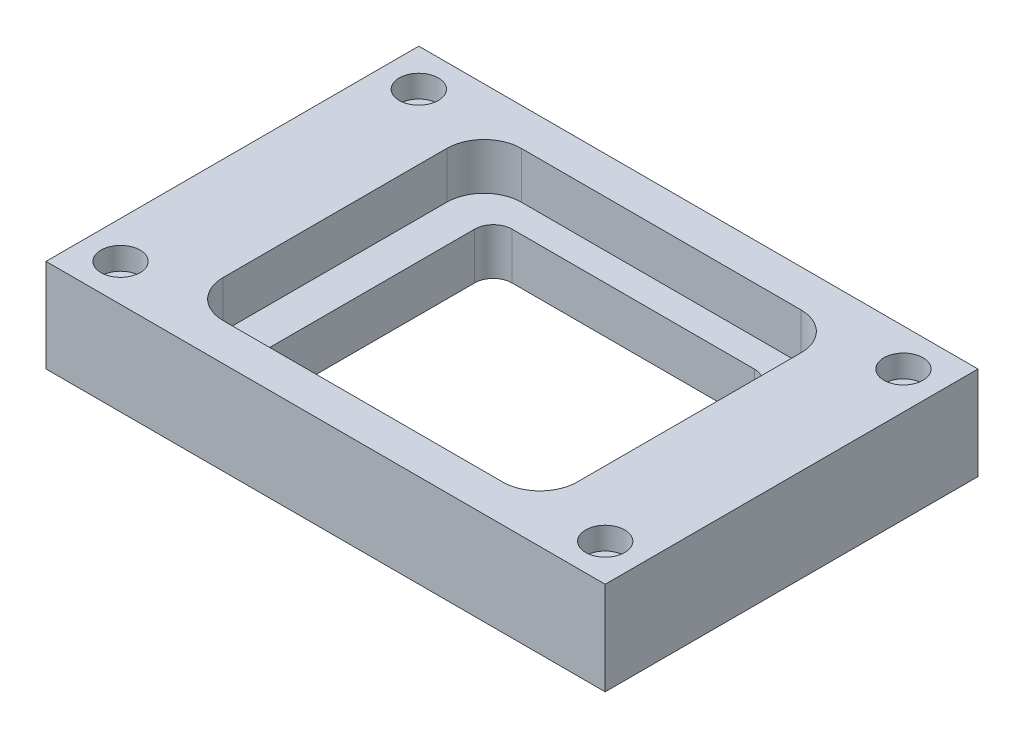
ISO-10303-21;
HEADER;
FILE_DESCRIPTION(('STEP AP214'),'2;1');
FILE_NAME('part.step','',(''),(''),'','','');
FILE_SCHEMA(('AUTOMOTIVE_DESIGN { 1 0 10303 214 1 1 1 1 }'));
ENDSEC;
DATA;
#1=APPLICATION_CONTEXT('core data for automotive mechanical design processes');
#2=APPLICATION_PROTOCOL_DEFINITION('international standard','automotive_design',2000,#1);
#3=PRODUCT_CONTEXT('',#1,'mechanical');
#4=PRODUCT('Part','Part','',(#3));
#5=PRODUCT_RELATED_PRODUCT_CATEGORY('part','',(#4));
#6=PRODUCT_DEFINITION_FORMATION('','',#4);
#7=PRODUCT_DEFINITION_CONTEXT('part definition',#1,'design');
#8=PRODUCT_DEFINITION('design','',#6,#7);
#9=PRODUCT_DEFINITION_SHAPE('','',#8);
#10=(LENGTH_UNIT() NAMED_UNIT(*) SI_UNIT(.MILLI.,.METRE.));
#11=(NAMED_UNIT(*) PLANE_ANGLE_UNIT() SI_UNIT($,.RADIAN.));
#12=(NAMED_UNIT(*) SI_UNIT($,.STERADIAN.) SOLID_ANGLE_UNIT());
#13=UNCERTAINTY_MEASURE_WITH_UNIT(LENGTH_MEASURE(1.E-05),#10,'distance_accuracy_value','');
#14=(GEOMETRIC_REPRESENTATION_CONTEXT(3) GLOBAL_UNCERTAINTY_ASSIGNED_CONTEXT((#13)) GLOBAL_UNIT_ASSIGNED_CONTEXT((#10,
#11,#12)) REPRESENTATION_CONTEXT('',''));
#15=CARTESIAN_POINT('',(0.,0.,0.));
#16=DIRECTION('',(0.,0.,1.));
#17=DIRECTION('',(1.,0.,0.));
#18=AXIS2_PLACEMENT_3D('',#15,#16,#17);
#19=CARTESIAN_POINT('',(0.,0.,0.));
#20=DIRECTION('',(0.,1.,0.));
#21=DIRECTION('',(0.,0.,1.));
#22=AXIS2_PLACEMENT_3D('',#19,#20,#21);
#23=PLANE('',#22);
#24=DIRECTION('',(0.,0.,-1.));
#25=VECTOR('',#24,1.);
#26=CARTESIAN_POINT('',(150.,0.,-100.));
#27=LINE('',#26,#25);
#28=CARTESIAN_POINT('',(150.,0.,100.));
#29=VERTEX_POINT('',#28);
#30=CARTESIAN_POINT('',(150.,0.,-100.));
#31=VERTEX_POINT('',#30);
#32=EDGE_CURVE('E385',#29,#31,#27,.T.);
#33=ORIENTED_EDGE('',*,*,#32,.F.);
#34=DIRECTION('',(1.,0.,0.));
#35=VECTOR('',#34,1.);
#36=CARTESIAN_POINT('',(-150.,0.,100.));
#37=LINE('',#36,#35);
#38=CARTESIAN_POINT('',(-150.,0.,100.));
#39=VERTEX_POINT('',#38);
#40=EDGE_CURVE('E360',#39,#29,#37,.T.);
#41=ORIENTED_EDGE('',*,*,#40,.F.);
#42=DIRECTION('',(0.,0.,1.));
#43=VECTOR('',#42,1.);
#44=CARTESIAN_POINT('',(-150.,0.,-100.));
#45=LINE('',#44,#43);
#46=CARTESIAN_POINT('',(-150.,0.,-100.));
#47=VERTEX_POINT('',#46);
#48=EDGE_CURVE('E456',#47,#39,#45,.T.);
#49=ORIENTED_EDGE('',*,*,#48,.F.);
#50=DIRECTION('',(-1.,0.,0.));
#51=VECTOR('',#50,1.);
#52=CARTESIAN_POINT('',(-150.,0.,-100.));
#53=LINE('',#52,#51);
#54=EDGE_CURVE('E446',#31,#47,#53,.T.);
#55=ORIENTED_EDGE('',*,*,#54,.F.);
#56=EDGE_LOOP('',(#33,#41,#49,#55));
#57=FACE_BOUND('',#56,.T.);
#58=CARTESIAN_POINT('',(-130.,0.,-80.));
#59=DIRECTION('',(0.,1.,0.));
#60=DIRECTION('',(0.,0.,1.));
#61=AXIS2_PLACEMENT_3D('',#58,#59,#60);
#62=CIRCLE('',#61,6.00000000000001);
#63=CARTESIAN_POINT('',(-130.,0.,-74.));
#64=VERTEX_POINT('',#63);
#65=EDGE_CURVE('E380',#64,#64,#62,.T.);
#66=ORIENTED_EDGE('',*,*,#65,.T.);
#67=EDGE_LOOP('',(#66));
#68=FACE_BOUND('',#67,.T.);
#69=CARTESIAN_POINT('',(130.,0.,-80.));
#70=DIRECTION('',(0.,1.,0.));
#71=DIRECTION('',(0.,0.,1.));
#72=AXIS2_PLACEMENT_3D('',#69,#70,#71);
#73=CIRCLE('',#72,6.00000000000001);
#74=CARTESIAN_POINT('',(130.,0.,-74.));
#75=VERTEX_POINT('',#74);
#76=EDGE_CURVE('E339',#75,#75,#73,.T.);
#77=ORIENTED_EDGE('',*,*,#76,.T.);
#78=EDGE_LOOP('',(#77));
#79=FACE_BOUND('',#78,.T.);
#80=CARTESIAN_POINT('',(130.,0.,80.));
#81=DIRECTION('',(0.,1.,0.));
#82=DIRECTION('',(0.,0.,1.));
#83=AXIS2_PLACEMENT_3D('',#80,#81,#82);
#84=CIRCLE('',#83,6.00000000000001);
#85=CARTESIAN_POINT('',(130.,0.,86.));
#86=VERTEX_POINT('',#85);
#87=EDGE_CURVE('E395',#86,#86,#84,.T.);
#88=ORIENTED_EDGE('',*,*,#87,.T.);
#89=EDGE_LOOP('',(#88));
#90=FACE_BOUND('',#89,.T.);
#91=CARTESIAN_POINT('',(-130.,0.,80.));
#92=DIRECTION('',(0.,1.,0.));
#93=DIRECTION('',(0.,0.,1.));
#94=AXIS2_PLACEMENT_3D('',#91,#92,#93);
#95=CIRCLE('',#94,6.00000000000001);
#96=CARTESIAN_POINT('',(-130.,0.,86.));
#97=VERTEX_POINT('',#96);
#98=EDGE_CURVE('E53',#97,#97,#95,.T.);
#99=ORIENTED_EDGE('',*,*,#98,.T.);
#100=EDGE_LOOP('',(#99));
#101=FACE_BOUND('',#100,.T.);
#102=DIRECTION('',(1.,0.,0.));
#103=VECTOR('',#102,1.);
#104=CARTESIAN_POINT('',(0.,0.,-65.));
#105=LINE('',#104,#103);
#106=CARTESIAN_POINT('',(-64.9999999999999,0.,-65.));
#107=VERTEX_POINT('',#106);
#108=CARTESIAN_POINT('',(64.9999999999999,0.,-65.));
#109=VERTEX_POINT('',#108);
#110=EDGE_CURVE('E203',#107,#109,#105,.T.);
#111=ORIENTED_EDGE('',*,*,#110,.F.);
#112=CARTESIAN_POINT('',(-65.,0.,-55.));
#113=DIRECTION('',(0.,1.,0.));
#114=DIRECTION('',(0.,0.,1.));
#115=AXIS2_PLACEMENT_3D('',#112,#113,#114);
#116=CIRCLE('',#115,9.99999999999999);
#117=CARTESIAN_POINT('',(-75.,0.,-54.9999999999999));
#118=VERTEX_POINT('',#117);
#119=EDGE_CURVE('E188',#107,#118,#116,.T.);
#120=ORIENTED_EDGE('',*,*,#119,.T.);
#121=DIRECTION('',(0.,0.,1.));
#122=VECTOR('',#121,1.);
#123=CARTESIAN_POINT('',(-75.,0.,0.));
#124=LINE('',#123,#122);
#125=CARTESIAN_POINT('',(-75.,0.,54.9999999999999));
#126=VERTEX_POINT('',#125);
#127=EDGE_CURVE('E197',#118,#126,#124,.T.);
#128=ORIENTED_EDGE('',*,*,#127,.T.);
#129=CARTESIAN_POINT('',(-65.,0.,55.));
#130=DIRECTION('',(0.,1.,0.));
#131=DIRECTION('',(0.,0.,1.));
#132=AXIS2_PLACEMENT_3D('',#129,#130,#131);
#133=CIRCLE('',#132,10.);
#134=CARTESIAN_POINT('',(-64.9999999999999,0.,65.));
#135=VERTEX_POINT('',#134);
#136=EDGE_CURVE('E1004',#126,#135,#133,.T.);
#137=ORIENTED_EDGE('',*,*,#136,.T.);
#138=DIRECTION('',(1.,0.,0.));
#139=VECTOR('',#138,1.);
#140=CARTESIAN_POINT('',(0.,0.,65.));
#141=LINE('',#140,#139);
#142=CARTESIAN_POINT('',(64.9999999999999,0.,65.));
#143=VERTEX_POINT('',#142);
#144=EDGE_CURVE('E1000',#135,#143,#141,.T.);
#145=ORIENTED_EDGE('',*,*,#144,.T.);
#146=CARTESIAN_POINT('',(65.,0.,55.));
#147=DIRECTION('',(0.,1.,0.));
#148=DIRECTION('',(0.,0.,1.));
#149=AXIS2_PLACEMENT_3D('',#146,#147,#148);
#150=CIRCLE('',#149,9.99999999999999);
#151=CARTESIAN_POINT('',(75.,0.,54.9999999999999));
#152=VERTEX_POINT('',#151);
#153=EDGE_CURVE('E997',#143,#152,#150,.T.);
#154=ORIENTED_EDGE('',*,*,#153,.T.);
#155=DIRECTION('',(0.,0.,1.));
#156=VECTOR('',#155,1.);
#157=CARTESIAN_POINT('',(75.,0.,0.));
#158=LINE('',#157,#156);
#159=CARTESIAN_POINT('',(75.,0.,-54.9999999999999));
#160=VERTEX_POINT('',#159);
#161=EDGE_CURVE('E224',#160,#152,#158,.T.);
#162=ORIENTED_EDGE('',*,*,#161,.F.);
#163=CARTESIAN_POINT('',(65.,0.,-55.));
#164=DIRECTION('',(0.,1.,0.));
#165=DIRECTION('',(0.,0.,1.));
#166=AXIS2_PLACEMENT_3D('',#163,#164,#165);
#167=CIRCLE('',#166,10.);
#168=EDGE_CURVE('E212',#160,#109,#167,.T.);
#169=ORIENTED_EDGE('',*,*,#168,.T.);
#170=EDGE_LOOP('',(#111,#120,#128,#137,#145,#154,#162,#169));
#171=FACE_BOUND('',#170,.T.);
#172=ADVANCED_FACE('F49',(#57,#68,#79,#90,#101,#171),#23,.F.);
#173=CARTESIAN_POINT('',(150.,50.,-100.));
#174=DIRECTION('',(-1.,0.,0.));
#175=DIRECTION('',(0.,0.,1.));
#176=AXIS2_PLACEMENT_3D('',#173,#174,#175);
#177=PLANE('',#176);
#178=ORIENTED_EDGE('',*,*,#32,.T.);
#179=DIRECTION('',(0.,-1.,0.));
#180=VECTOR('',#179,1.);
#181=CARTESIAN_POINT('',(150.,50.,-100.));
#182=LINE('',#181,#180);
#183=CARTESIAN_POINT('',(150.,50.,-100.));
#184=VERTEX_POINT('',#183);
#185=EDGE_CURVE('E12',#184,#31,#182,.T.);
#186=ORIENTED_EDGE('',*,*,#185,.F.);
#187=DIRECTION('',(0.,0.,-1.));
#188=VECTOR('',#187,1.);
#189=CARTESIAN_POINT('',(150.,50.,-100.));
#190=LINE('',#189,#188);
#191=CARTESIAN_POINT('',(150.,50.,100.));
#192=VERTEX_POINT('',#191);
#193=EDGE_CURVE('E355',#192,#184,#190,.T.);
#194=ORIENTED_EDGE('',*,*,#193,.F.);
#195=DIRECTION('',(0.,-1.,0.));
#196=VECTOR('',#195,1.);
#197=CARTESIAN_POINT('',(150.,50.,100.));
#198=LINE('',#197,#196);
#199=EDGE_CURVE('E460',#192,#29,#198,.T.);
#200=ORIENTED_EDGE('',*,*,#199,.T.);
#201=EDGE_LOOP('',(#178,#186,#194,#200));
#202=FACE_BOUND('',#201,.T.);
#203=ADVANCED_FACE('F51',(#202),#177,.F.);
#204=CARTESIAN_POINT('',(-150.,50.,-100.));
#205=DIRECTION('',(0.,0.,1.));
#206=DIRECTION('',(1.,0.,0.));
#207=AXIS2_PLACEMENT_3D('',#204,#205,#206);
#208=PLANE('',#207);
#209=ORIENTED_EDGE('',*,*,#54,.T.);
#210=DIRECTION('',(0.,-1.,0.));
#211=VECTOR('',#210,1.);
#212=CARTESIAN_POINT('',(-150.,50.,-100.));
#213=LINE('',#212,#211);
#214=CARTESIAN_POINT('',(-150.,50.,-100.));
#215=VERTEX_POINT('',#214);
#216=EDGE_CURVE('E60',#215,#47,#213,.T.);
#217=ORIENTED_EDGE('',*,*,#216,.F.);
#218=DIRECTION('',(-1.,0.,0.));
#219=VECTOR('',#218,1.);
#220=CARTESIAN_POINT('',(-150.,50.,-100.));
#221=LINE('',#220,#219);
#222=EDGE_CURVE('E359',#184,#215,#221,.T.);
#223=ORIENTED_EDGE('',*,*,#222,.F.);
#224=ORIENTED_EDGE('',*,*,#185,.T.);
#225=EDGE_LOOP('',(#209,#217,#223,#224));
#226=FACE_BOUND('',#225,.T.);
#227=ADVANCED_FACE('F445',(#226),#208,.F.);
#228=CARTESIAN_POINT('',(-150.,50.,-100.));
#229=DIRECTION('',(1.,0.,0.));
#230=DIRECTION('',(0.,0.,-1.));
#231=AXIS2_PLACEMENT_3D('',#228,#229,#230);
#232=PLANE('',#231);
#233=ORIENTED_EDGE('',*,*,#48,.T.);
#234=DIRECTION('',(0.,-1.,0.));
#235=VECTOR('',#234,1.);
#236=CARTESIAN_POINT('',(-150.,50.,100.));
#237=LINE('',#236,#235);
#238=CARTESIAN_POINT('',(-150.,50.,100.));
#239=VERTEX_POINT('',#238);
#240=EDGE_CURVE('E452',#239,#39,#237,.T.);
#241=ORIENTED_EDGE('',*,*,#240,.F.);
#242=DIRECTION('',(0.,0.,1.));
#243=VECTOR('',#242,1.);
#244=CARTESIAN_POINT('',(-150.,50.,-100.));
#245=LINE('',#244,#243);
#246=EDGE_CURVE('E366',#215,#239,#245,.T.);
#247=ORIENTED_EDGE('',*,*,#246,.F.);
#248=ORIENTED_EDGE('',*,*,#216,.T.);
#249=EDGE_LOOP('',(#233,#241,#247,#248));
#250=FACE_BOUND('',#249,.T.);
#251=ADVANCED_FACE('F454',(#250),#232,.F.);
#252=CARTESIAN_POINT('',(-150.,50.,100.));
#253=DIRECTION('',(0.,0.,-1.));
#254=DIRECTION('',(-1.,0.,0.));
#255=AXIS2_PLACEMENT_3D('',#252,#253,#254);
#256=PLANE('',#255);
#257=ORIENTED_EDGE('',*,*,#40,.T.);
#258=ORIENTED_EDGE('',*,*,#199,.F.);
#259=DIRECTION('',(1.,0.,0.));
#260=VECTOR('',#259,1.);
#261=CARTESIAN_POINT('',(-150.,50.,100.));
#262=LINE('',#261,#260);
#263=EDGE_CURVE('E370',#239,#192,#262,.T.);
#264=ORIENTED_EDGE('',*,*,#263,.F.);
#265=ORIENTED_EDGE('',*,*,#240,.T.);
#266=EDGE_LOOP('',(#257,#258,#264,#265));
#267=FACE_BOUND('',#266,.T.);
#268=ADVANCED_FACE('F428',(#267),#256,.F.);
#269=CARTESIAN_POINT('',(0.,50.,0.));
#270=DIRECTION('',(0.,1.,0.));
#271=DIRECTION('',(0.,0.,1.));
#272=AXIS2_PLACEMENT_3D('',#269,#270,#271);
#273=PLANE('',#272);
#274=CARTESIAN_POINT('',(-75.,50.,60.));
#275=DIRECTION('',(0.,1.,0.));
#276=DIRECTION('',(0.,0.,1.));
#277=AXIS2_PLACEMENT_3D('',#274,#275,#276);
#278=CIRCLE('',#277,20.);
#279=CARTESIAN_POINT('',(-95.,50.,59.9999999999999));
#280=VERTEX_POINT('',#279);
#281=CARTESIAN_POINT('',(-74.9999999999999,50.,80.));
#282=VERTEX_POINT('',#281);
#283=EDGE_CURVE('E76',#280,#282,#278,.T.);
#284=ORIENTED_EDGE('',*,*,#283,.F.);
#285=DIRECTION('',(0.,0.,1.));
#286=VECTOR('',#285,1.);
#287=CARTESIAN_POINT('',(-95.,50.,-59.9999999999998));
#288=LINE('',#287,#286);
#289=CARTESIAN_POINT('',(-95.,50.,-59.9999999999998));
#290=VERTEX_POINT('',#289);
#291=EDGE_CURVE('E268',#290,#280,#288,.T.);
#292=ORIENTED_EDGE('',*,*,#291,.F.);
#293=CARTESIAN_POINT('',(-75.,50.,-60.));
#294=DIRECTION('',(0.,1.,0.));
#295=DIRECTION('',(0.,0.,1.));
#296=AXIS2_PLACEMENT_3D('',#293,#294,#295);
#297=CIRCLE('',#296,20.);
#298=CARTESIAN_POINT('',(-74.9999999999999,50.,-80.));
#299=VERTEX_POINT('',#298);
#300=EDGE_CURVE('E483',#299,#290,#297,.T.);
#301=ORIENTED_EDGE('',*,*,#300,.F.);
#302=DIRECTION('',(-1.,0.,0.));
#303=VECTOR('',#302,1.);
#304=CARTESIAN_POINT('',(-74.9999999999999,50.,-80.));
#305=LINE('',#304,#303);
#306=CARTESIAN_POINT('',(74.9999999999998,50.,-80.));
#307=VERTEX_POINT('',#306);
#308=EDGE_CURVE('E534',#307,#299,#305,.T.);
#309=ORIENTED_EDGE('',*,*,#308,.F.);
#310=CARTESIAN_POINT('',(75.,50.,-60.));
#311=DIRECTION('',(0.,1.,0.));
#312=DIRECTION('',(0.,0.,-1.));
#313=AXIS2_PLACEMENT_3D('',#310,#311,#312);
#314=CIRCLE('',#313,20.);
#315=CARTESIAN_POINT('',(95.,50.,-59.9999999999998));
#316=VERTEX_POINT('',#315);
#317=EDGE_CURVE('E530',#316,#307,#314,.T.);
#318=ORIENTED_EDGE('',*,*,#317,.F.);
#319=DIRECTION('',(0.,0.,-1.));
#320=VECTOR('',#319,1.);
#321=CARTESIAN_POINT('',(95.,50.,-59.9999999999998));
#322=LINE('',#321,#320);
#323=CARTESIAN_POINT('',(95.,50.,59.9999999999999));
#324=VERTEX_POINT('',#323);
#325=EDGE_CURVE('E513',#324,#316,#322,.T.);
#326=ORIENTED_EDGE('',*,*,#325,.F.);
#327=CARTESIAN_POINT('',(75.,50.,60.));
#328=DIRECTION('',(0.,1.,0.));
#329=DIRECTION('',(0.,0.,1.));
#330=AXIS2_PLACEMENT_3D('',#327,#328,#329);
#331=CIRCLE('',#330,20.);
#332=CARTESIAN_POINT('',(74.9999999999999,50.,80.));
#333=VERTEX_POINT('',#332);
#334=EDGE_CURVE('E521',#333,#324,#331,.T.);
#335=ORIENTED_EDGE('',*,*,#334,.F.);
#336=DIRECTION('',(1.,0.,0.));
#337=VECTOR('',#336,1.);
#338=CARTESIAN_POINT('',(-74.9999999999999,50.,80.));
#339=LINE('',#338,#337);
#340=EDGE_CURVE('E526',#282,#333,#339,.T.);
#341=ORIENTED_EDGE('',*,*,#340,.F.);
#342=EDGE_LOOP('',(#284,#292,#301,#309,#318,#326,#335,#341));
#343=FACE_BOUND('',#342,.T.);
#344=CARTESIAN_POINT('',(-130.,50.,80.));
#345=DIRECTION('',(0.,1.,0.));
#346=DIRECTION('',(0.,0.,1.));
#347=AXIS2_PLACEMENT_3D('',#344,#345,#346);
#348=CIRCLE('',#347,10.5);
#349=CARTESIAN_POINT('',(-130.,50.,90.5));
#350=VERTEX_POINT('',#349);
#351=EDGE_CURVE('E298',#350,#350,#348,.T.);
#352=ORIENTED_EDGE('',*,*,#351,.F.);
#353=EDGE_LOOP('',(#352));
#354=FACE_BOUND('',#353,.T.);
#355=CARTESIAN_POINT('',(130.,50.,80.));
#356=DIRECTION('',(0.,1.,0.));
#357=DIRECTION('',(0.,0.,1.));
#358=AXIS2_PLACEMENT_3D('',#355,#356,#357);
#359=CIRCLE('',#358,10.5);
#360=CARTESIAN_POINT('',(130.,50.,90.5));
#361=VERTEX_POINT('',#360);
#362=EDGE_CURVE('E316',#361,#361,#359,.T.);
#363=ORIENTED_EDGE('',*,*,#362,.F.);
#364=EDGE_LOOP('',(#363));
#365=FACE_BOUND('',#364,.T.);
#366=CARTESIAN_POINT('',(130.,50.,-80.));
#367=DIRECTION('',(0.,1.,0.));
#368=DIRECTION('',(0.,0.,1.));
#369=AXIS2_PLACEMENT_3D('',#366,#367,#368);
#370=CIRCLE('',#369,10.5);
#371=CARTESIAN_POINT('',(130.,50.,-69.5));
#372=VERTEX_POINT('',#371);
#373=EDGE_CURVE('E399',#372,#372,#370,.T.);
#374=ORIENTED_EDGE('',*,*,#373,.F.);
#375=EDGE_LOOP('',(#374));
#376=FACE_BOUND('',#375,.T.);
#377=CARTESIAN_POINT('',(-130.,50.,-80.));
#378=DIRECTION('',(0.,1.,0.));
#379=DIRECTION('',(0.,0.,1.));
#380=AXIS2_PLACEMENT_3D('',#377,#378,#379);
#381=CIRCLE('',#380,10.5);
#382=CARTESIAN_POINT('',(-130.,50.,-69.5));
#383=VERTEX_POINT('',#382);
#384=EDGE_CURVE('E342',#383,#383,#381,.T.);
#385=ORIENTED_EDGE('',*,*,#384,.F.);
#386=EDGE_LOOP('',(#385));
#387=FACE_BOUND('',#386,.T.);
#388=ORIENTED_EDGE('',*,*,#193,.T.);
#389=ORIENTED_EDGE('',*,*,#222,.T.);
#390=ORIENTED_EDGE('',*,*,#246,.T.);
#391=ORIENTED_EDGE('',*,*,#263,.T.);
#392=EDGE_LOOP('',(#388,#389,#390,#391));
#393=FACE_BOUND('',#392,.T.);
#394=ADVANCED_FACE('F424',(#343,#354,#365,#376,#387,#393),#273,.T.);
#395=CARTESIAN_POINT('',(-130.,50.,-80.));
#396=DIRECTION('',(0.,1.,0.));
#397=DIRECTION('',(0.,0.,1.));
#398=AXIS2_PLACEMENT_3D('',#395,#396,#397);
#399=CYLINDRICAL_SURFACE('',#398,6.00000000000001);
#400=CARTESIAN_POINT('',(-130.,38.,-80.));
#401=DIRECTION('',(0.,1.,0.));
#402=DIRECTION('',(0.,0.,1.));
#403=AXIS2_PLACEMENT_3D('',#400,#401,#402);
#404=CIRCLE('',#403,6.00000000000001);
#405=CARTESIAN_POINT('',(-130.,38.,-74.));
#406=VERTEX_POINT('',#405);
#407=EDGE_CURVE('E361',#406,#406,#404,.T.);
#408=ORIENTED_EDGE('',*,*,#407,.T.);
#409=EDGE_LOOP('',(#408));
#410=FACE_BOUND('',#409,.T.);
#411=ORIENTED_EDGE('',*,*,#65,.F.);
#412=EDGE_LOOP('',(#411));
#413=FACE_BOUND('',#412,.T.);
#414=ADVANCED_FACE('F427',(#410,#413),#399,.F.);
#415=CARTESIAN_POINT('',(-124.,38.,-80.));
#416=DIRECTION('',(0.,-1.,0.));
#417=DIRECTION('',(0.,0.,-1.));
#418=AXIS2_PLACEMENT_3D('',#415,#416,#417);
#419=PLANE('',#418);
#420=ORIENTED_EDGE('',*,*,#407,.F.);
#421=EDGE_LOOP('',(#420));
#422=FACE_BOUND('',#421,.T.);
#423=CARTESIAN_POINT('',(-130.,38.,-80.));
#424=DIRECTION('',(0.,1.,0.));
#425=DIRECTION('',(0.,0.,1.));
#426=AXIS2_PLACEMENT_3D('',#423,#424,#425);
#427=CIRCLE('',#426,10.5);
#428=CARTESIAN_POINT('',(-130.,38.,-69.5));
#429=VERTEX_POINT('',#428);
#430=EDGE_CURVE('E347',#429,#429,#427,.T.);
#431=ORIENTED_EDGE('',*,*,#430,.T.);
#432=EDGE_LOOP('',(#431));
#433=FACE_BOUND('',#432,.T.);
#434=ADVANCED_FACE('F615',(#422,#433),#419,.F.);
#435=CARTESIAN_POINT('',(-130.,50.,-80.));
#436=DIRECTION('',(0.,1.,0.));
#437=DIRECTION('',(0.,0.,1.));
#438=AXIS2_PLACEMENT_3D('',#435,#436,#437);
#439=CYLINDRICAL_SURFACE('',#438,10.5);
#440=ORIENTED_EDGE('',*,*,#430,.F.);
#441=EDGE_LOOP('',(#440));
#442=FACE_BOUND('',#441,.T.);
#443=ORIENTED_EDGE('',*,*,#384,.T.);
#444=EDGE_LOOP('',(#443));
#445=FACE_BOUND('',#444,.T.);
#446=ADVANCED_FACE('F622',(#442,#445),#439,.F.);
#447=CARTESIAN_POINT('',(130.,50.,-80.));
#448=DIRECTION('',(0.,1.,0.));
#449=DIRECTION('',(0.,0.,1.));
#450=AXIS2_PLACEMENT_3D('',#447,#448,#449);
#451=CYLINDRICAL_SURFACE('',#450,6.00000000000001);
#452=CARTESIAN_POINT('',(130.,38.,-80.));
#453=DIRECTION('',(0.,1.,0.));
#454=DIRECTION('',(0.,0.,1.));
#455=AXIS2_PLACEMENT_3D('',#452,#453,#454);
#456=CIRCLE('',#455,6.00000000000001);
#457=CARTESIAN_POINT('',(130.,38.,-74.));
#458=VERTEX_POINT('',#457);
#459=EDGE_CURVE('E334',#458,#458,#456,.T.);
#460=ORIENTED_EDGE('',*,*,#459,.T.);
#461=EDGE_LOOP('',(#460));
#462=FACE_BOUND('',#461,.T.);
#463=ORIENTED_EDGE('',*,*,#76,.F.);
#464=EDGE_LOOP('',(#463));
#465=FACE_BOUND('',#464,.T.);
#466=ADVANCED_FACE('F630',(#462,#465),#451,.F.);
#467=CARTESIAN_POINT('',(136.,38.,-80.));
#468=DIRECTION('',(0.,-1.,0.));
#469=DIRECTION('',(0.,0.,-1.));
#470=AXIS2_PLACEMENT_3D('',#467,#468,#469);
#471=PLANE('',#470);
#472=ORIENTED_EDGE('',*,*,#459,.F.);
#473=EDGE_LOOP('',(#472));
#474=FACE_BOUND('',#473,.T.);
#475=CARTESIAN_POINT('',(130.,38.,-80.));
#476=DIRECTION('',(0.,1.,0.));
#477=DIRECTION('',(0.,0.,1.));
#478=AXIS2_PLACEMENT_3D('',#475,#476,#477);
#479=CIRCLE('',#478,10.5);
#480=CARTESIAN_POINT('',(130.,38.,-69.5));
#481=VERTEX_POINT('',#480);
#482=EDGE_CURVE('E340',#481,#481,#479,.T.);
#483=ORIENTED_EDGE('',*,*,#482,.T.);
#484=EDGE_LOOP('',(#483));
#485=FACE_BOUND('',#484,.T.);
#486=ADVANCED_FACE('F638',(#474,#485),#471,.F.);
#487=CARTESIAN_POINT('',(130.,50.,-80.));
#488=DIRECTION('',(0.,1.,0.));
#489=DIRECTION('',(0.,0.,1.));
#490=AXIS2_PLACEMENT_3D('',#487,#488,#489);
#491=CYLINDRICAL_SURFACE('',#490,10.5);
#492=ORIENTED_EDGE('',*,*,#482,.F.);
#493=EDGE_LOOP('',(#492));
#494=FACE_BOUND('',#493,.T.);
#495=ORIENTED_EDGE('',*,*,#373,.T.);
#496=EDGE_LOOP('',(#495));
#497=FACE_BOUND('',#496,.T.);
#498=ADVANCED_FACE('F647',(#494,#497),#491,.F.);
#499=CARTESIAN_POINT('',(130.,50.,80.));
#500=DIRECTION('',(0.,1.,0.));
#501=DIRECTION('',(0.,0.,1.));
#502=AXIS2_PLACEMENT_3D('',#499,#500,#501);
#503=CYLINDRICAL_SURFACE('',#502,6.00000000000001);
#504=CARTESIAN_POINT('',(130.,38.,80.));
#505=DIRECTION('',(0.,1.,0.));
#506=DIRECTION('',(0.,0.,1.));
#507=AXIS2_PLACEMENT_3D('',#504,#505,#506);
#508=CIRCLE('',#507,6.00000000000001);
#509=CARTESIAN_POINT('',(130.,38.,86.));
#510=VERTEX_POINT('',#509);
#511=EDGE_CURVE('E327',#510,#510,#508,.T.);
#512=ORIENTED_EDGE('',*,*,#511,.T.);
#513=EDGE_LOOP('',(#512));
#514=FACE_BOUND('',#513,.T.);
#515=ORIENTED_EDGE('',*,*,#87,.F.);
#516=EDGE_LOOP('',(#515));
#517=FACE_BOUND('',#516,.T.);
#518=ADVANCED_FACE('F408',(#514,#517),#503,.F.);
#519=CARTESIAN_POINT('',(136.,38.,80.));
#520=DIRECTION('',(0.,-1.,0.));
#521=DIRECTION('',(0.,0.,-1.));
#522=AXIS2_PLACEMENT_3D('',#519,#520,#521);
#523=PLANE('',#522);
#524=ORIENTED_EDGE('',*,*,#511,.F.);
#525=EDGE_LOOP('',(#524));
#526=FACE_BOUND('',#525,.T.);
#527=CARTESIAN_POINT('',(130.,38.,80.));
#528=DIRECTION('',(0.,1.,0.));
#529=DIRECTION('',(0.,0.,1.));
#530=AXIS2_PLACEMENT_3D('',#527,#528,#529);
#531=CIRCLE('',#530,10.5);
#532=CARTESIAN_POINT('',(130.,38.,90.5));
#533=VERTEX_POINT('',#532);
#534=EDGE_CURVE('E321',#533,#533,#531,.T.);
#535=ORIENTED_EDGE('',*,*,#534,.T.);
#536=EDGE_LOOP('',(#535));
#537=FACE_BOUND('',#536,.T.);
#538=ADVANCED_FACE('F411',(#526,#537),#523,.F.);
#539=CARTESIAN_POINT('',(130.,50.,80.));
#540=DIRECTION('',(0.,1.,0.));
#541=DIRECTION('',(0.,0.,1.));
#542=AXIS2_PLACEMENT_3D('',#539,#540,#541);
#543=CYLINDRICAL_SURFACE('',#542,10.5);
#544=ORIENTED_EDGE('',*,*,#534,.F.);
#545=EDGE_LOOP('',(#544));
#546=FACE_BOUND('',#545,.T.);
#547=ORIENTED_EDGE('',*,*,#362,.T.);
#548=EDGE_LOOP('',(#547));
#549=FACE_BOUND('',#548,.T.);
#550=ADVANCED_FACE('F414',(#546,#549),#543,.F.);
#551=CARTESIAN_POINT('',(-130.,50.,80.));
#552=DIRECTION('',(0.,1.,0.));
#553=DIRECTION('',(0.,0.,1.));
#554=AXIS2_PLACEMENT_3D('',#551,#552,#553);
#555=CYLINDRICAL_SURFACE('',#554,6.00000000000001);
#556=CARTESIAN_POINT('',(-130.,38.,80.));
#557=DIRECTION('',(0.,1.,0.));
#558=DIRECTION('',(0.,0.,1.));
#559=AXIS2_PLACEMENT_3D('',#556,#557,#558);
#560=CIRCLE('',#559,6.00000000000001);
#561=CARTESIAN_POINT('',(-130.,38.,86.));
#562=VERTEX_POINT('',#561);
#563=EDGE_CURVE('E322',#562,#562,#560,.T.);
#564=ORIENTED_EDGE('',*,*,#563,.T.);
#565=EDGE_LOOP('',(#564));
#566=FACE_BOUND('',#565,.T.);
#567=ORIENTED_EDGE('',*,*,#98,.F.);
#568=EDGE_LOOP('',(#567));
#569=FACE_BOUND('',#568,.T.);
#570=ADVANCED_FACE('F420',(#566,#569),#555,.F.);
#571=CARTESIAN_POINT('',(-124.,38.,80.));
#572=DIRECTION('',(0.,-1.,0.));
#573=DIRECTION('',(0.,0.,-1.));
#574=AXIS2_PLACEMENT_3D('',#571,#572,#573);
#575=PLANE('',#574);
#576=ORIENTED_EDGE('',*,*,#563,.F.);
#577=EDGE_LOOP('',(#576));
#578=FACE_BOUND('',#577,.T.);
#579=CARTESIAN_POINT('',(-130.,38.,80.));
#580=DIRECTION('',(0.,1.,0.));
#581=DIRECTION('',(0.,0.,1.));
#582=AXIS2_PLACEMENT_3D('',#579,#580,#581);
#583=CIRCLE('',#582,10.5);
#584=CARTESIAN_POINT('',(-130.,38.,90.5));
#585=VERTEX_POINT('',#584);
#586=EDGE_CURVE('E303',#585,#585,#583,.T.);
#587=ORIENTED_EDGE('',*,*,#586,.T.);
#588=EDGE_LOOP('',(#587));
#589=FACE_BOUND('',#588,.T.);
#590=ADVANCED_FACE('F571',(#578,#589),#575,.F.);
#591=CARTESIAN_POINT('',(-130.,50.,80.));
#592=DIRECTION('',(0.,1.,0.));
#593=DIRECTION('',(0.,0.,1.));
#594=AXIS2_PLACEMENT_3D('',#591,#592,#593);
#595=CYLINDRICAL_SURFACE('',#594,10.5);
#596=ORIENTED_EDGE('',*,*,#586,.F.);
#597=EDGE_LOOP('',(#596));
#598=FACE_BOUND('',#597,.T.);
#599=ORIENTED_EDGE('',*,*,#351,.T.);
#600=EDGE_LOOP('',(#599));
#601=FACE_BOUND('',#600,.T.);
#602=ADVANCED_FACE('F577',(#598,#601),#595,.F.);
#603=CARTESIAN_POINT('',(-75.,25.,60.));
#604=DIRECTION('',(0.,1.,0.));
#605=DIRECTION('',(0.,0.,1.));
#606=AXIS2_PLACEMENT_3D('',#603,#604,#605);
#607=CYLINDRICAL_SURFACE('',#606,20.);
#608=ORIENTED_EDGE('',*,*,#283,.T.);
#609=DIRECTION('',(0.,1.,0.));
#610=VECTOR('',#609,1.);
#611=CARTESIAN_POINT('',(-74.9999999999999,25.,80.));
#612=LINE('',#611,#610);
#613=CARTESIAN_POINT('',(-74.9999999999999,25.,80.));
#614=VERTEX_POINT('',#613);
#615=EDGE_CURVE('E291',#614,#282,#612,.T.);
#616=ORIENTED_EDGE('',*,*,#615,.F.);
#617=CARTESIAN_POINT('',(-75.,25.,60.));
#618=DIRECTION('',(0.,1.,0.));
#619=DIRECTION('',(0.,0.,1.));
#620=AXIS2_PLACEMENT_3D('',#617,#618,#619);
#621=CIRCLE('',#620,20.);
#622=CARTESIAN_POINT('',(-95.,25.,59.9999999999999));
#623=VERTEX_POINT('',#622);
#624=EDGE_CURVE('E262',#623,#614,#621,.T.);
#625=ORIENTED_EDGE('',*,*,#624,.F.);
#626=DIRECTION('',(0.,1.,0.));
#627=VECTOR('',#626,1.);
#628=CARTESIAN_POINT('',(-95.,25.,59.9999999999999));
#629=LINE('',#628,#627);
#630=EDGE_CURVE('E304',#623,#280,#629,.T.);
#631=ORIENTED_EDGE('',*,*,#630,.T.);
#632=EDGE_LOOP('',(#608,#616,#625,#631));
#633=FACE_BOUND('',#632,.T.);
#634=ADVANCED_FACE('F691',(#633),#607,.F.);
#635=CARTESIAN_POINT('',(-95.,25.,-59.9999999999998));
#636=DIRECTION('',(-1.,0.,0.));
#637=DIRECTION('',(0.,0.,1.));
#638=AXIS2_PLACEMENT_3D('',#635,#636,#637);
#639=PLANE('',#638);
#640=ORIENTED_EDGE('',*,*,#291,.T.);
#641=ORIENTED_EDGE('',*,*,#630,.F.);
#642=DIRECTION('',(0.,0.,1.));
#643=VECTOR('',#642,1.);
#644=CARTESIAN_POINT('',(-95.,25.,-59.9999999999998));
#645=LINE('',#644,#643);
#646=CARTESIAN_POINT('',(-95.,25.,-59.9999999999998));
#647=VERTEX_POINT('',#646);
#648=EDGE_CURVE('E297',#647,#623,#645,.T.);
#649=ORIENTED_EDGE('',*,*,#648,.F.);
#650=DIRECTION('',(0.,1.,0.));
#651=VECTOR('',#650,1.);
#652=CARTESIAN_POINT('',(-95.,25.,-59.9999999999998));
#653=LINE('',#652,#651);
#654=EDGE_CURVE('E488',#647,#290,#653,.T.);
#655=ORIENTED_EDGE('',*,*,#654,.T.);
#656=EDGE_LOOP('',(#640,#641,#649,#655));
#657=FACE_BOUND('',#656,.T.);
#658=ADVANCED_FACE('F555',(#657),#639,.F.);
#659=CARTESIAN_POINT('',(-75.,25.,-60.));
#660=DIRECTION('',(0.,1.,0.));
#661=DIRECTION('',(0.,0.,1.));
#662=AXIS2_PLACEMENT_3D('',#659,#660,#661);
#663=CYLINDRICAL_SURFACE('',#662,20.);
#664=ORIENTED_EDGE('',*,*,#300,.T.);
#665=ORIENTED_EDGE('',*,*,#654,.F.);
#666=CARTESIAN_POINT('',(-75.,25.,-60.));
#667=DIRECTION('',(0.,1.,0.));
#668=DIRECTION('',(0.,0.,1.));
#669=AXIS2_PLACEMENT_3D('',#666,#667,#668);
#670=CIRCLE('',#669,20.);
#671=CARTESIAN_POINT('',(-74.9999999999999,25.,-80.));
#672=VERTEX_POINT('',#671);
#673=EDGE_CURVE('E1073',#672,#647,#670,.T.);
#674=ORIENTED_EDGE('',*,*,#673,.F.);
#675=DIRECTION('',(0.,1.,0.));
#676=VECTOR('',#675,1.);
#677=CARTESIAN_POINT('',(-74.9999999999999,25.,-80.));
#678=LINE('',#677,#676);
#679=EDGE_CURVE('E498',#672,#299,#678,.T.);
#680=ORIENTED_EDGE('',*,*,#679,.T.);
#681=EDGE_LOOP('',(#664,#665,#674,#680));
#682=FACE_BOUND('',#681,.T.);
#683=ADVANCED_FACE('F551',(#682),#663,.F.);
#684=CARTESIAN_POINT('',(-74.9999999999999,25.,-80.));
#685=DIRECTION('',(0.,0.,-1.));
#686=DIRECTION('',(-1.,0.,0.));
#687=AXIS2_PLACEMENT_3D('',#684,#685,#686);
#688=PLANE('',#687);
#689=ORIENTED_EDGE('',*,*,#308,.T.);
#690=ORIENTED_EDGE('',*,*,#679,.F.);
#691=DIRECTION('',(-1.,0.,0.));
#692=VECTOR('',#691,1.);
#693=CARTESIAN_POINT('',(-74.9999999999999,25.,-80.));
#694=LINE('',#693,#692);
#695=CARTESIAN_POINT('',(74.9999999999998,25.,-80.));
#696=VERTEX_POINT('',#695);
#697=EDGE_CURVE('E1077',#696,#672,#694,.T.);
#698=ORIENTED_EDGE('',*,*,#697,.F.);
#699=DIRECTION('',(0.,1.,0.));
#700=VECTOR('',#699,1.);
#701=CARTESIAN_POINT('',(74.9999999999998,25.,-80.));
#702=LINE('',#701,#700);
#703=EDGE_CURVE('E495',#696,#307,#702,.T.);
#704=ORIENTED_EDGE('',*,*,#703,.T.);
#705=EDGE_LOOP('',(#689,#690,#698,#704));
#706=FACE_BOUND('',#705,.T.);
#707=ADVANCED_FACE('F720',(#706),#688,.F.);
#708=CARTESIAN_POINT('',(75.,25.,-60.));
#709=DIRECTION('',(0.,1.,0.));
#710=DIRECTION('',(0.,0.,1.));
#711=AXIS2_PLACEMENT_3D('',#708,#709,#710);
#712=CYLINDRICAL_SURFACE('',#711,20.);
#713=ORIENTED_EDGE('',*,*,#317,.T.);
#714=ORIENTED_EDGE('',*,*,#703,.F.);
#715=CARTESIAN_POINT('',(75.,25.,-60.));
#716=DIRECTION('',(0.,1.,0.));
#717=DIRECTION('',(0.,0.,-1.));
#718=AXIS2_PLACEMENT_3D('',#715,#716,#717);
#719=CIRCLE('',#718,20.);
#720=CARTESIAN_POINT('',(95.,25.,-59.9999999999998));
#721=VERTEX_POINT('',#720);
#722=EDGE_CURVE('E1082',#721,#696,#719,.T.);
#723=ORIENTED_EDGE('',*,*,#722,.F.);
#724=DIRECTION('',(0.,1.,0.));
#725=VECTOR('',#724,1.);
#726=CARTESIAN_POINT('',(95.,25.,-59.9999999999998));
#727=LINE('',#726,#725);
#728=EDGE_CURVE('E499',#721,#316,#727,.T.);
#729=ORIENTED_EDGE('',*,*,#728,.T.);
#730=EDGE_LOOP('',(#713,#714,#723,#729));
#731=FACE_BOUND('',#730,.T.);
#732=ADVANCED_FACE('F728',(#731),#712,.F.);
#733=CARTESIAN_POINT('',(95.,25.,-59.9999999999998));
#734=DIRECTION('',(1.,0.,0.));
#735=DIRECTION('',(0.,0.,-1.));
#736=AXIS2_PLACEMENT_3D('',#733,#734,#735);
#737=PLANE('',#736);
#738=ORIENTED_EDGE('',*,*,#325,.T.);
#739=ORIENTED_EDGE('',*,*,#728,.F.);
#740=DIRECTION('',(0.,0.,-1.));
#741=VECTOR('',#740,1.);
#742=CARTESIAN_POINT('',(95.,25.,-59.9999999999998));
#743=LINE('',#742,#741);
#744=CARTESIAN_POINT('',(95.,25.,59.9999999999999));
#745=VERTEX_POINT('',#744);
#746=EDGE_CURVE('E516',#745,#721,#743,.T.);
#747=ORIENTED_EDGE('',*,*,#746,.F.);
#748=DIRECTION('',(0.,1.,0.));
#749=VECTOR('',#748,1.);
#750=CARTESIAN_POINT('',(95.,25.,59.9999999999999));
#751=LINE('',#750,#749);
#752=EDGE_CURVE('E290',#745,#324,#751,.T.);
#753=ORIENTED_EDGE('',*,*,#752,.T.);
#754=EDGE_LOOP('',(#738,#739,#747,#753));
#755=FACE_BOUND('',#754,.T.);
#756=ADVANCED_FACE('F511',(#755),#737,.F.);
#757=CARTESIAN_POINT('',(75.,25.,60.));
#758=DIRECTION('',(0.,1.,0.));
#759=DIRECTION('',(0.,0.,1.));
#760=AXIS2_PLACEMENT_3D('',#757,#758,#759);
#761=CYLINDRICAL_SURFACE('',#760,20.);
#762=ORIENTED_EDGE('',*,*,#334,.T.);
#763=ORIENTED_EDGE('',*,*,#752,.F.);
#764=CARTESIAN_POINT('',(75.,25.,60.));
#765=DIRECTION('',(0.,1.,0.));
#766=DIRECTION('',(0.,0.,1.));
#767=AXIS2_PLACEMENT_3D('',#764,#765,#766);
#768=CIRCLE('',#767,20.);
#769=CARTESIAN_POINT('',(74.9999999999999,25.,80.));
#770=VERTEX_POINT('',#769);
#771=EDGE_CURVE('E275',#770,#745,#768,.T.);
#772=ORIENTED_EDGE('',*,*,#771,.F.);
#773=DIRECTION('',(0.,1.,0.));
#774=VECTOR('',#773,1.);
#775=CARTESIAN_POINT('',(74.9999999999999,25.,80.));
#776=LINE('',#775,#774);
#777=EDGE_CURVE('E286',#770,#333,#776,.T.);
#778=ORIENTED_EDGE('',*,*,#777,.T.);
#779=EDGE_LOOP('',(#762,#763,#772,#778));
#780=FACE_BOUND('',#779,.T.);
#781=ADVANCED_FACE('F522',(#780),#761,.F.);
#782=CARTESIAN_POINT('',(-74.9999999999999,25.,80.));
#783=DIRECTION('',(0.,0.,1.));
#784=DIRECTION('',(1.,0.,0.));
#785=AXIS2_PLACEMENT_3D('',#782,#783,#784);
#786=PLANE('',#785);
#787=ORIENTED_EDGE('',*,*,#340,.T.);
#788=ORIENTED_EDGE('',*,*,#777,.F.);
#789=DIRECTION('',(1.,0.,0.));
#790=VECTOR('',#789,1.);
#791=CARTESIAN_POINT('',(-74.9999999999999,25.,80.));
#792=LINE('',#791,#790);
#793=EDGE_CURVE('E267',#614,#770,#792,.T.);
#794=ORIENTED_EDGE('',*,*,#793,.F.);
#795=ORIENTED_EDGE('',*,*,#615,.T.);
#796=EDGE_LOOP('',(#787,#788,#794,#795));
#797=FACE_BOUND('',#796,.T.);
#798=ADVANCED_FACE('F752',(#797),#786,.F.);
#799=CARTESIAN_POINT('',(-75.,25.,60.));
#800=DIRECTION('',(0.,1.,0.));
#801=DIRECTION('',(0.,0.,1.));
#802=AXIS2_PLACEMENT_3D('',#799,#800,#801);
#803=PLANE('',#802);
#804=DIRECTION('',(0.,0.,1.));
#805=VECTOR('',#804,1.);
#806=CARTESIAN_POINT('',(-75.,25.,-54.9999999999999));
#807=LINE('',#806,#805);
#808=CARTESIAN_POINT('',(-75.,25.,-54.9999999999999));
#809=VERTEX_POINT('',#808);
#810=CARTESIAN_POINT('',(-75.,25.,54.9999999999999));
#811=VERTEX_POINT('',#810);
#812=EDGE_CURVE('E269',#809,#811,#807,.T.);
#813=ORIENTED_EDGE('',*,*,#812,.F.);
#814=CARTESIAN_POINT('',(-65.,25.,-55.));
#815=DIRECTION('',(0.,1.,0.));
#816=DIRECTION('',(0.,0.,1.));
#817=AXIS2_PLACEMENT_3D('',#814,#815,#816);
#818=CIRCLE('',#817,9.99999999999999);
#819=CARTESIAN_POINT('',(-64.9999999999999,25.,-65.));
#820=VERTEX_POINT('',#819);
#821=EDGE_CURVE('E249',#820,#809,#818,.T.);
#822=ORIENTED_EDGE('',*,*,#821,.F.);
#823=DIRECTION('',(-1.,0.,0.));
#824=VECTOR('',#823,1.);
#825=CARTESIAN_POINT('',(-64.9999999999999,25.,-65.));
#826=LINE('',#825,#824);
#827=CARTESIAN_POINT('',(64.9999999999999,25.,-65.));
#828=VERTEX_POINT('',#827);
#829=EDGE_CURVE('E206',#828,#820,#826,.T.);
#830=ORIENTED_EDGE('',*,*,#829,.F.);
#831=CARTESIAN_POINT('',(65.,25.,-55.));
#832=DIRECTION('',(0.,1.,0.));
#833=DIRECTION('',(0.,0.,1.));
#834=AXIS2_PLACEMENT_3D('',#831,#832,#833);
#835=CIRCLE('',#834,10.);
#836=CARTESIAN_POINT('',(75.,25.,-54.9999999999999));
#837=VERTEX_POINT('',#836);
#838=EDGE_CURVE('E238',#837,#828,#835,.T.);
#839=ORIENTED_EDGE('',*,*,#838,.F.);
#840=DIRECTION('',(0.,0.,-1.));
#841=VECTOR('',#840,1.);
#842=CARTESIAN_POINT('',(75.,25.,-54.9999999999999));
#843=LINE('',#842,#841);
#844=CARTESIAN_POINT('',(75.,25.,54.9999999999999));
#845=VERTEX_POINT('',#844);
#846=EDGE_CURVE('E243',#845,#837,#843,.T.);
#847=ORIENTED_EDGE('',*,*,#846,.F.);
#848=CARTESIAN_POINT('',(65.,25.,55.));
#849=DIRECTION('',(0.,1.,0.));
#850=DIRECTION('',(0.,0.,1.));
#851=AXIS2_PLACEMENT_3D('',#848,#849,#850);
#852=CIRCLE('',#851,9.99999999999999);
#853=CARTESIAN_POINT('',(64.9999999999999,25.,65.));
#854=VERTEX_POINT('',#853);
#855=EDGE_CURVE('E993',#854,#845,#852,.T.);
#856=ORIENTED_EDGE('',*,*,#855,.F.);
#857=DIRECTION('',(1.,0.,0.));
#858=VECTOR('',#857,1.);
#859=CARTESIAN_POINT('',(-64.9999999999999,25.,65.));
#860=LINE('',#859,#858);
#861=CARTESIAN_POINT('',(-64.9999999999999,25.,65.));
#862=VERTEX_POINT('',#861);
#863=EDGE_CURVE('E221',#862,#854,#860,.T.);
#864=ORIENTED_EDGE('',*,*,#863,.F.);
#865=CARTESIAN_POINT('',(-65.,25.,55.));
#866=DIRECTION('',(0.,1.,0.));
#867=DIRECTION('',(0.,0.,1.));
#868=AXIS2_PLACEMENT_3D('',#865,#866,#867);
#869=CIRCLE('',#868,10.);
#870=EDGE_CURVE('E214',#811,#862,#869,.T.);
#871=ORIENTED_EDGE('',*,*,#870,.F.);
#872=EDGE_LOOP('',(#813,#822,#830,#839,#847,#856,#864,#871));
#873=FACE_BOUND('',#872,.T.);
#874=ORIENTED_EDGE('',*,*,#624,.T.);
#875=ORIENTED_EDGE('',*,*,#793,.T.);
#876=ORIENTED_EDGE('',*,*,#771,.T.);
#877=ORIENTED_EDGE('',*,*,#746,.T.);
#878=ORIENTED_EDGE('',*,*,#722,.T.);
#879=ORIENTED_EDGE('',*,*,#697,.T.);
#880=ORIENTED_EDGE('',*,*,#673,.T.);
#881=ORIENTED_EDGE('',*,*,#648,.T.);
#882=EDGE_LOOP('',(#874,#875,#876,#877,#878,#879,#880,#881));
#883=FACE_BOUND('',#882,.T.);
#884=ADVANCED_FACE('F760',(#873,#883),#803,.T.);
#885=CARTESIAN_POINT('',(0.,-0.999999999999994,-65.));
#886=DIRECTION('',(0.,0.,1.));
#887=DIRECTION('',(1.,0.,0.));
#888=AXIS2_PLACEMENT_3D('',#885,#886,#887);
#889=PLANE('',#888);
#890=ORIENTED_EDGE('',*,*,#110,.T.);
#891=DIRECTION('',(0.,1.,0.));
#892=VECTOR('',#891,1.);
#893=CARTESIAN_POINT('',(64.9999999999999,-0.999999999999994,-65.));
#894=LINE('',#893,#892);
#895=EDGE_CURVE('E198',#109,#828,#894,.T.);
#896=ORIENTED_EDGE('',*,*,#895,.T.);
#897=ORIENTED_EDGE('',*,*,#829,.T.);
#898=DIRECTION('',(0.,1.,0.));
#899=VECTOR('',#898,1.);
#900=CARTESIAN_POINT('',(-64.9999999999999,-0.999999999999994,-65.));
#901=LINE('',#900,#899);
#902=EDGE_CURVE('E191',#107,#820,#901,.T.);
#903=ORIENTED_EDGE('',*,*,#902,.F.);
#904=EDGE_LOOP('',(#890,#896,#897,#903));
#905=FACE_BOUND('',#904,.T.);
#906=ADVANCED_FACE('F201',(#905),#889,.T.);
#907=CARTESIAN_POINT('',(65.,-0.999999999999994,-55.));
#908=DIRECTION('',(0.,1.,0.));
#909=DIRECTION('',(0.,0.,1.));
#910=AXIS2_PLACEMENT_3D('',#907,#908,#909);
#911=CYLINDRICAL_SURFACE('',#910,10.);
#912=DIRECTION('',(0.,1.,0.));
#913=VECTOR('',#912,1.);
#914=CARTESIAN_POINT('',(75.,-0.999999999999994,-54.9999999999999));
#915=LINE('',#914,#913);
#916=EDGE_CURVE('E1011',#160,#837,#915,.T.);
#917=ORIENTED_EDGE('',*,*,#916,.T.);
#918=ORIENTED_EDGE('',*,*,#838,.T.);
#919=ORIENTED_EDGE('',*,*,#895,.F.);
#920=ORIENTED_EDGE('',*,*,#168,.F.);
#921=EDGE_LOOP('',(#917,#918,#919,#920));
#922=FACE_BOUND('',#921,.T.);
#923=ADVANCED_FACE('F778',(#922),#911,.F.);
#924=CARTESIAN_POINT('',(75.,-0.999999999999994,0.));
#925=DIRECTION('',(-1.,0.,0.));
#926=DIRECTION('',(0.,0.,1.));
#927=AXIS2_PLACEMENT_3D('',#924,#925,#926);
#928=PLANE('',#927);
#929=ORIENTED_EDGE('',*,*,#161,.T.);
#930=DIRECTION('',(0.,1.,0.));
#931=VECTOR('',#930,1.);
#932=CARTESIAN_POINT('',(75.,-0.999999999999994,54.9999999999999));
#933=LINE('',#932,#931);
#934=EDGE_CURVE('E1015',#152,#845,#933,.T.);
#935=ORIENTED_EDGE('',*,*,#934,.T.);
#936=ORIENTED_EDGE('',*,*,#846,.T.);
#937=ORIENTED_EDGE('',*,*,#916,.F.);
#938=EDGE_LOOP('',(#929,#935,#936,#937));
#939=FACE_BOUND('',#938,.T.);
#940=ADVANCED_FACE('F788',(#939),#928,.T.);
#941=CARTESIAN_POINT('',(65.,-0.999999999999994,55.));
#942=DIRECTION('',(0.,1.,0.));
#943=DIRECTION('',(0.,0.,1.));
#944=AXIS2_PLACEMENT_3D('',#941,#942,#943);
#945=CYLINDRICAL_SURFACE('',#944,9.99999999999999);
#946=DIRECTION('',(0.,1.,0.));
#947=VECTOR('',#946,1.);
#948=CARTESIAN_POINT('',(64.9999999999999,-0.999999999999994,65.));
#949=LINE('',#948,#947);
#950=EDGE_CURVE('E1019',#143,#854,#949,.T.);
#951=ORIENTED_EDGE('',*,*,#950,.T.);
#952=ORIENTED_EDGE('',*,*,#855,.T.);
#953=ORIENTED_EDGE('',*,*,#934,.F.);
#954=ORIENTED_EDGE('',*,*,#153,.F.);
#955=EDGE_LOOP('',(#951,#952,#953,#954));
#956=FACE_BOUND('',#955,.T.);
#957=ADVANCED_FACE('F800',(#956),#945,.F.);
#958=CARTESIAN_POINT('',(0.,-0.999999999999994,65.));
#959=DIRECTION('',(0.,0.,1.));
#960=DIRECTION('',(1.,0.,0.));
#961=AXIS2_PLACEMENT_3D('',#958,#959,#960);
#962=PLANE('',#961);
#963=DIRECTION('',(0.,1.,0.));
#964=VECTOR('',#963,1.);
#965=CARTESIAN_POINT('',(-64.9999999999999,-0.999999999999994,65.));
#966=LINE('',#965,#964);
#967=EDGE_CURVE('E1023',#135,#862,#966,.T.);
#968=ORIENTED_EDGE('',*,*,#967,.T.);
#969=ORIENTED_EDGE('',*,*,#863,.T.);
#970=ORIENTED_EDGE('',*,*,#950,.F.);
#971=ORIENTED_EDGE('',*,*,#144,.F.);
#972=EDGE_LOOP('',(#968,#969,#970,#971));
#973=FACE_BOUND('',#972,.T.);
#974=ADVANCED_FACE('F810',(#973),#962,.F.);
#975=CARTESIAN_POINT('',(-65.,-0.999999999999994,55.));
#976=DIRECTION('',(0.,1.,0.));
#977=DIRECTION('',(0.,0.,1.));
#978=AXIS2_PLACEMENT_3D('',#975,#976,#977);
#979=CYLINDRICAL_SURFACE('',#978,10.);
#980=DIRECTION('',(0.,1.,0.));
#981=VECTOR('',#980,1.);
#982=CARTESIAN_POINT('',(-75.,-0.999999999999994,54.9999999999999));
#983=LINE('',#982,#981);
#984=EDGE_CURVE('E982',#126,#811,#983,.T.);
#985=ORIENTED_EDGE('',*,*,#984,.T.);
#986=ORIENTED_EDGE('',*,*,#870,.T.);
#987=ORIENTED_EDGE('',*,*,#967,.F.);
#988=ORIENTED_EDGE('',*,*,#136,.F.);
#989=EDGE_LOOP('',(#985,#986,#987,#988));
#990=FACE_BOUND('',#989,.T.);
#991=ADVANCED_FACE('F819',(#990),#979,.F.);
#992=CARTESIAN_POINT('',(-75.,-0.999999999999994,0.));
#993=DIRECTION('',(-1.,0.,0.));
#994=DIRECTION('',(0.,0.,1.));
#995=AXIS2_PLACEMENT_3D('',#992,#993,#994);
#996=PLANE('',#995);
#997=DIRECTION('',(0.,1.,0.));
#998=VECTOR('',#997,1.);
#999=CARTESIAN_POINT('',(-75.,-0.999999999999994,-54.9999999999999));
#1000=LINE('',#999,#998);
#1001=EDGE_CURVE('E68',#118,#809,#1000,.T.);
#1002=ORIENTED_EDGE('',*,*,#1001,.T.);
#1003=ORIENTED_EDGE('',*,*,#812,.T.);
#1004=ORIENTED_EDGE('',*,*,#984,.F.);
#1005=ORIENTED_EDGE('',*,*,#127,.F.);
#1006=EDGE_LOOP('',(#1002,#1003,#1004,#1005));
#1007=FACE_BOUND('',#1006,.T.);
#1008=ADVANCED_FACE('F829',(#1007),#996,.F.);
#1009=CARTESIAN_POINT('',(-65.,-0.999999999999994,-55.));
#1010=DIRECTION('',(0.,1.,0.));
#1011=DIRECTION('',(0.,0.,1.));
#1012=AXIS2_PLACEMENT_3D('',#1009,#1010,#1011);
#1013=CYLINDRICAL_SURFACE('',#1012,9.99999999999999);
#1014=ORIENTED_EDGE('',*,*,#902,.T.);
#1015=ORIENTED_EDGE('',*,*,#821,.T.);
#1016=ORIENTED_EDGE('',*,*,#1001,.F.);
#1017=ORIENTED_EDGE('',*,*,#119,.F.);
#1018=EDGE_LOOP('',(#1014,#1015,#1016,#1017));
#1019=FACE_BOUND('',#1018,.T.);
#1020=ADVANCED_FACE('F190',(#1019),#1013,.F.);
#1021=CLOSED_SHELL('',(#172,#203,#227,#251,#268,#394,#414,#434,#446,#466,#486,#498,#518,#538,
#550,#570,#590,#602,#634,#658,#683,#707,#732,#756,#781,#798,#884,#906,#923,#940,#957,#974,#991,
#1008,#1020));
#1022=MANIFOLD_SOLID_BREP('B2',#1021);
#1023=ADVANCED_BREP_SHAPE_REPRESENTATION('',(#18,#1022),#14);
#1024=SHAPE_DEFINITION_REPRESENTATION(#9,#1023);
ENDSEC;
END-ISO-10303-21;
